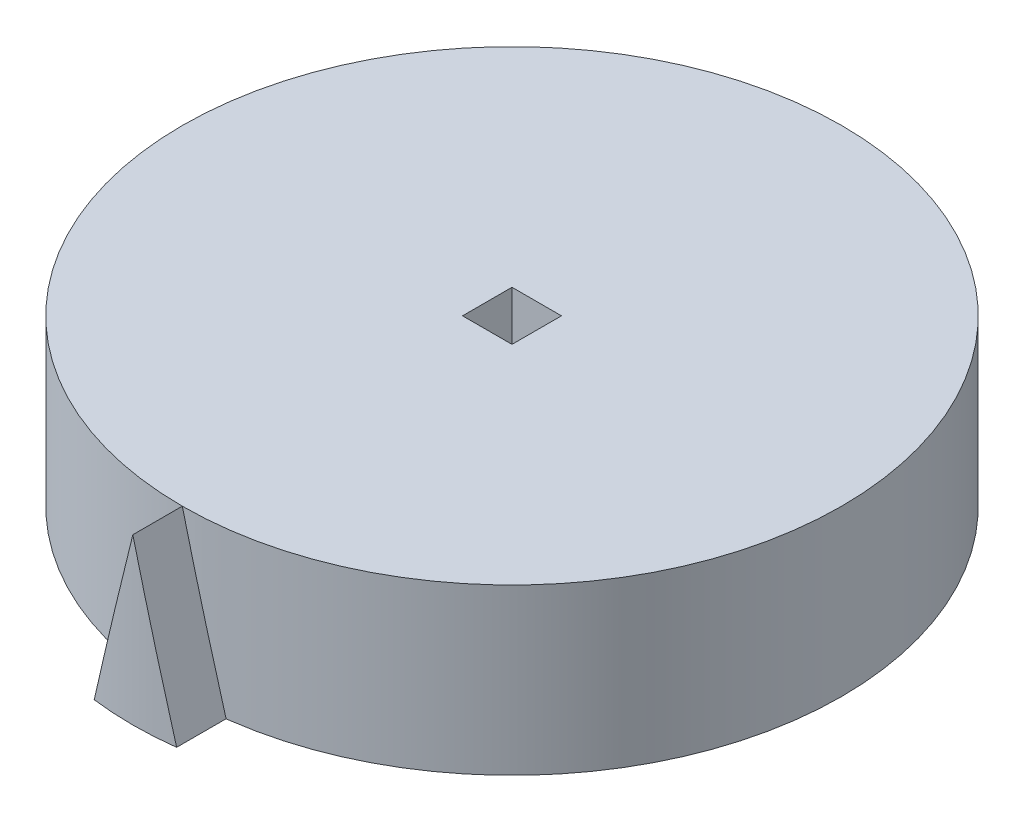
ISO-10303-21;
HEADER;
FILE_DESCRIPTION(('STEP AP214'),'2;1');
FILE_NAME('part.step','',(''),(''),'','','');
FILE_SCHEMA(('AUTOMOTIVE_DESIGN { 1 0 10303 214 1 1 1 1 }'));
ENDSEC;
DATA;
#1=APPLICATION_CONTEXT('core data for automotive mechanical design processes');
#2=APPLICATION_PROTOCOL_DEFINITION('international standard','automotive_design',2000,#1);
#3=PRODUCT_CONTEXT('',#1,'mechanical');
#4=PRODUCT('Part','Part','',(#3));
#5=PRODUCT_RELATED_PRODUCT_CATEGORY('part','',(#4));
#6=PRODUCT_DEFINITION_FORMATION('','',#4);
#7=PRODUCT_DEFINITION_CONTEXT('part definition',#1,'design');
#8=PRODUCT_DEFINITION('design','',#6,#7);
#9=PRODUCT_DEFINITION_SHAPE('','',#8);
#10=(LENGTH_UNIT() NAMED_UNIT(*) SI_UNIT(.MILLI.,.METRE.));
#11=(NAMED_UNIT(*) PLANE_ANGLE_UNIT() SI_UNIT($,.RADIAN.));
#12=(NAMED_UNIT(*) SI_UNIT($,.STERADIAN.) SOLID_ANGLE_UNIT());
#13=UNCERTAINTY_MEASURE_WITH_UNIT(LENGTH_MEASURE(1.E-05),#10,'distance_accuracy_value','');
#14=(GEOMETRIC_REPRESENTATION_CONTEXT(3) GLOBAL_UNCERTAINTY_ASSIGNED_CONTEXT((#13)) GLOBAL_UNIT_ASSIGNED_CONTEXT((#10,
#11,#12)) REPRESENTATION_CONTEXT('',''));
#15=CARTESIAN_POINT('',(0.,0.,0.));
#16=DIRECTION('',(0.,0.,1.));
#17=DIRECTION('',(1.,0.,0.));
#18=AXIS2_PLACEMENT_3D('',#15,#16,#17);
#19=CARTESIAN_POINT('',(0.,10.,0.));
#20=DIRECTION('',(0.,1.,0.));
#21=DIRECTION('',(0.,0.,1.));
#22=AXIS2_PLACEMENT_3D('',#19,#20,#21);
#23=PLANE('',#22);
#24=CARTESIAN_POINT('',(0.,10.,0.));
#25=DIRECTION('',(0.,1.,0.));
#26=DIRECTION('',(0.,0.,1.));
#27=AXIS2_PLACEMENT_3D('',#24,#25,#26);
#28=CIRCLE('',#27,20.);
#29=CARTESIAN_POINT('',(2.50842797400203E-08,10.,20.));
#30=VERTEX_POINT('',#29);
#31=EDGE_CURVE('E11',#30,#30,#28,.T.);
#32=ORIENTED_EDGE('',*,*,#31,.T.);
#33=EDGE_LOOP('',(#32));
#34=FACE_BOUND('',#33,.T.);
#35=DIRECTION('',(1.,0.,0.));
#36=VECTOR('',#35,1.);
#37=CARTESIAN_POINT('',(-1.5,10.,1.5));
#38=LINE('',#37,#36);
#39=CARTESIAN_POINT('',(-1.5,10.,1.5));
#40=VERTEX_POINT('',#39);
#41=CARTESIAN_POINT('',(1.5,10.,1.5));
#42=VERTEX_POINT('',#41);
#43=EDGE_CURVE('E132',#40,#42,#38,.T.);
#44=ORIENTED_EDGE('',*,*,#43,.F.);
#45=DIRECTION('',(0.,0.,1.));
#46=VECTOR('',#45,1.);
#47=CARTESIAN_POINT('',(-1.5,10.,-1.5));
#48=LINE('',#47,#46);
#49=CARTESIAN_POINT('',(-1.5,10.,-1.5));
#50=VERTEX_POINT('',#49);
#51=EDGE_CURVE('E134',#50,#40,#48,.T.);
#52=ORIENTED_EDGE('',*,*,#51,.F.);
#53=DIRECTION('',(-1.,0.,0.));
#54=VECTOR('',#53,1.);
#55=CARTESIAN_POINT('',(-1.5,10.,-1.5));
#56=LINE('',#55,#54);
#57=CARTESIAN_POINT('',(1.5,10.,-1.5));
#58=VERTEX_POINT('',#57);
#59=EDGE_CURVE('E140',#58,#50,#56,.T.);
#60=ORIENTED_EDGE('',*,*,#59,.F.);
#61=DIRECTION('',(0.,0.,-1.));
#62=VECTOR('',#61,1.);
#63=CARTESIAN_POINT('',(1.5,10.,-1.5));
#64=LINE('',#63,#62);
#65=EDGE_CURVE('E135',#42,#58,#64,.T.);
#66=ORIENTED_EDGE('',*,*,#65,.F.);
#67=EDGE_LOOP('',(#44,#52,#60,#66));
#68=FACE_BOUND('',#67,.T.);
#69=ADVANCED_FACE('F33',(#34,#68),#23,.T.);
#70=CARTESIAN_POINT('',(0.,0.,0.));
#71=DIRECTION('',(0.,1.,0.));
#72=DIRECTION('',(0.,0.,1.));
#73=AXIS2_PLACEMENT_3D('',#70,#71,#72);
#74=PLANE('',#73);
#75=CARTESIAN_POINT('',(0.,0.,0.));
#76=DIRECTION('',(0.,1.,0.));
#77=DIRECTION('',(0.,0.,1.));
#78=AXIS2_PLACEMENT_3D('',#75,#76,#77);
#79=CIRCLE('',#78,20.);
#80=CARTESIAN_POINT('',(0.,0.,20.));
#81=VERTEX_POINT('',#80);
#82=EDGE_CURVE('E44',#81,#81,#79,.T.);
#83=ORIENTED_EDGE('',*,*,#82,.F.);
#84=EDGE_LOOP('',(#83));
#85=FACE_BOUND('',#84,.T.);
#86=DIRECTION('',(0.,0.,1.));
#87=VECTOR('',#86,1.);
#88=CARTESIAN_POINT('',(-1.5,0.,-1.5));
#89=LINE('',#88,#87);
#90=CARTESIAN_POINT('',(-1.5,0.,-1.5));
#91=VERTEX_POINT('',#90);
#92=CARTESIAN_POINT('',(-1.5,0.,1.5));
#93=VERTEX_POINT('',#92);
#94=EDGE_CURVE('E118',#91,#93,#89,.T.);
#95=ORIENTED_EDGE('',*,*,#94,.T.);
#96=DIRECTION('',(1.,0.,0.));
#97=VECTOR('',#96,1.);
#98=CARTESIAN_POINT('',(-1.5,0.,1.5));
#99=LINE('',#98,#97);
#100=CARTESIAN_POINT('',(1.5,0.,1.5));
#101=VERTEX_POINT('',#100);
#102=EDGE_CURVE('E150',#93,#101,#99,.T.);
#103=ORIENTED_EDGE('',*,*,#102,.T.);
#104=DIRECTION('',(0.,0.,-1.));
#105=VECTOR('',#104,1.);
#106=CARTESIAN_POINT('',(1.5,0.,-1.5));
#107=LINE('',#106,#105);
#108=CARTESIAN_POINT('',(1.5,0.,-1.5));
#109=VERTEX_POINT('',#108);
#110=EDGE_CURVE('E153',#101,#109,#107,.T.);
#111=ORIENTED_EDGE('',*,*,#110,.T.);
#112=DIRECTION('',(-1.,0.,0.));
#113=VECTOR('',#112,1.);
#114=CARTESIAN_POINT('',(-1.5,0.,-1.5));
#115=LINE('',#114,#113);
#116=EDGE_CURVE('E142',#109,#91,#115,.T.);
#117=ORIENTED_EDGE('',*,*,#116,.T.);
#118=EDGE_LOOP('',(#95,#103,#111,#117));
#119=FACE_BOUND('',#118,.T.);
#120=ADVANCED_FACE('F127',(#85,#119),#74,.F.);
#121=CARTESIAN_POINT('',(0.,10.,0.));
#122=DIRECTION('',(0.,-1.,0.));
#123=DIRECTION('',(0.,0.,-1.));
#124=AXIS2_PLACEMENT_3D('',#121,#122,#123);
#125=CYLINDRICAL_SURFACE('',#124,20.);
#126=CARTESIAN_POINT('',(2.5,0.00176765201369278,19.8431348329844));
#127=CARTESIAN_POINT('',(1.25492133612456,4.98120196119248,20.));
#128=CARTESIAN_POINT('',(0.,10.,20.));
#129=B_SPLINE_CURVE_WITH_KNOTS('',2,(#126,#127,#128),.UNSPECIFIED.,.F.,.F.,(3,3),(0.,1.),.UNSPECIFIED.);
#130=CARTESIAN_POINT('',(2.5,0.00176765201369278,19.8431348329844));
#131=VERTEX_POINT('',#130);
#132=EDGE_CURVE('E111',#131,#30,#129,.T.);
#133=ORIENTED_EDGE('',*,*,#132,.F.);
#134=CARTESIAN_POINT('',(0.,0.00176765201370145,0.));
#135=DIRECTION('',(0.,1.,0.));
#136=DIRECTION('',(-1.,0.,0.));
#137=AXIS2_PLACEMENT_3D('',#134,#135,#136);
#138=CIRCLE('',#137,20.);
#139=CARTESIAN_POINT('',(-2.5,0.00176765201370926,19.8431348329844));
#140=VERTEX_POINT('',#139);
#141=EDGE_CURVE('E52',#140,#131,#138,.T.);
#142=ORIENTED_EDGE('',*,*,#141,.F.);
#143=CARTESIAN_POINT('',(0.,10.,20.));
#144=CARTESIAN_POINT('',(-1.25492133612456,4.98120196119251,20.));
#145=CARTESIAN_POINT('',(-2.5,0.00176765201371186,19.8431348329844));
#146=B_SPLINE_CURVE_WITH_KNOTS('',2,(#143,#144,#145),.UNSPECIFIED.,.F.,.F.,(3,3),(0.,1.),.UNSPECIFIED.);
#147=EDGE_CURVE('E103',#30,#140,#146,.T.);
#148=ORIENTED_EDGE('',*,*,#147,.F.);
#149=ORIENTED_EDGE('',*,*,#31,.F.);
#150=EDGE_LOOP('',(#133,#142,#148,#149));
#151=FACE_BOUND('',#150,.T.);
#152=ORIENTED_EDGE('',*,*,#82,.T.);
#153=EDGE_LOOP('',(#152));
#154=FACE_BOUND('',#153,.T.);
#155=ADVANCED_FACE('F35',(#151,#154),#125,.T.);
#156=CARTESIAN_POINT('',(-1.5,10.,-1.5));
#157=DIRECTION('',(1.,0.,0.));
#158=DIRECTION('',(0.,0.,-1.));
#159=AXIS2_PLACEMENT_3D('',#156,#157,#158);
#160=PLANE('',#159);
#161=ORIENTED_EDGE('',*,*,#94,.F.);
#162=DIRECTION('',(0.,-1.,0.));
#163=VECTOR('',#162,1.);
#164=CARTESIAN_POINT('',(-1.5,10.,-1.5));
#165=LINE('',#164,#163);
#166=EDGE_CURVE('E147',#50,#91,#165,.T.);
#167=ORIENTED_EDGE('',*,*,#166,.F.);
#168=ORIENTED_EDGE('',*,*,#51,.T.);
#169=DIRECTION('',(0.,-1.,0.));
#170=VECTOR('',#169,1.);
#171=CARTESIAN_POINT('',(-1.5,10.,1.5));
#172=LINE('',#171,#170);
#173=EDGE_CURVE('E163',#40,#93,#172,.T.);
#174=ORIENTED_EDGE('',*,*,#173,.T.);
#175=EDGE_LOOP('',(#161,#167,#168,#174));
#176=FACE_BOUND('',#175,.T.);
#177=ADVANCED_FACE('F182',(#176),#160,.T.);
#178=CARTESIAN_POINT('',(-1.5,10.,1.5));
#179=DIRECTION('',(0.,0.,-1.));
#180=DIRECTION('',(-1.,0.,0.));
#181=AXIS2_PLACEMENT_3D('',#178,#179,#180);
#182=PLANE('',#181);
#183=ORIENTED_EDGE('',*,*,#102,.F.);
#184=ORIENTED_EDGE('',*,*,#173,.F.);
#185=ORIENTED_EDGE('',*,*,#43,.T.);
#186=DIRECTION('',(0.,-1.,0.));
#187=VECTOR('',#186,1.);
#188=CARTESIAN_POINT('',(1.5,10.,1.5));
#189=LINE('',#188,#187);
#190=EDGE_CURVE('E161',#42,#101,#189,.T.);
#191=ORIENTED_EDGE('',*,*,#190,.T.);
#192=EDGE_LOOP('',(#183,#184,#185,#191));
#193=FACE_BOUND('',#192,.T.);
#194=ADVANCED_FACE('F187',(#193),#182,.T.);
#195=CARTESIAN_POINT('',(1.5,10.,-1.5));
#196=DIRECTION('',(-1.,0.,0.));
#197=DIRECTION('',(0.,0.,1.));
#198=AXIS2_PLACEMENT_3D('',#195,#196,#197);
#199=PLANE('',#198);
#200=ORIENTED_EDGE('',*,*,#110,.F.);
#201=ORIENTED_EDGE('',*,*,#190,.F.);
#202=ORIENTED_EDGE('',*,*,#65,.T.);
#203=DIRECTION('',(0.,-1.,0.));
#204=VECTOR('',#203,1.);
#205=CARTESIAN_POINT('',(1.5,10.,-1.5));
#206=LINE('',#205,#204);
#207=EDGE_CURVE('E60',#58,#109,#206,.T.);
#208=ORIENTED_EDGE('',*,*,#207,.T.);
#209=EDGE_LOOP('',(#200,#201,#202,#208));
#210=FACE_BOUND('',#209,.T.);
#211=ADVANCED_FACE('F186',(#210),#199,.T.);
#212=CARTESIAN_POINT('',(-1.5,10.,-1.5));
#213=DIRECTION('',(0.,0.,1.));
#214=DIRECTION('',(1.,0.,0.));
#215=AXIS2_PLACEMENT_3D('',#212,#213,#214);
#216=PLANE('',#215);
#217=ORIENTED_EDGE('',*,*,#116,.F.);
#218=ORIENTED_EDGE('',*,*,#207,.F.);
#219=ORIENTED_EDGE('',*,*,#59,.T.);
#220=ORIENTED_EDGE('',*,*,#166,.T.);
#221=EDGE_LOOP('',(#217,#218,#219,#220));
#222=FACE_BOUND('',#221,.T.);
#223=ADVANCED_FACE('F183',(#222),#216,.T.);
#224=CARTESIAN_POINT('',(0.,10.,3.));
#225=DIRECTION('',(0.,-1.,0.));
#226=DIRECTION('',(0.,0.,-1.));
#227=AXIS2_PLACEMENT_3D('',#224,#225,#226);
#228=CYLINDRICAL_SURFACE('',#227,20.);
#229=CARTESIAN_POINT('',(0.,0.00176765201370145,3.));
#230=DIRECTION('',(0.,1.,0.));
#231=DIRECTION('',(-1.,0.,0.));
#232=AXIS2_PLACEMENT_3D('',#229,#230,#231);
#233=CIRCLE('',#232,20.);
#234=CARTESIAN_POINT('',(-2.5,0.00176765201370926,22.8431348329844));
#235=VERTEX_POINT('',#234);
#236=CARTESIAN_POINT('',(2.5,0.00176765201369711,22.8431348329844));
#237=VERTEX_POINT('',#236);
#238=EDGE_CURVE('E225',#235,#237,#233,.T.);
#239=ORIENTED_EDGE('',*,*,#238,.T.);
#240=CARTESIAN_POINT('',(2.5,0.00176765201369278,22.8431348329844));
#241=CARTESIAN_POINT('',(2.45002307996604,0.201640294537291,22.8494313199102));
#242=CARTESIAN_POINT('',(2.40004483964416,0.401518642311657,22.8555361941008));
#243=CARTESIAN_POINT('',(2.29881308308869,0.806375446422704,22.8675142410236));
#244=CARTESIAN_POINT('',(2.24755949754091,1.01135417711984,22.8733775562176));
#245=CARTESIAN_POINT('',(2.14377678771398,1.42641174099608,22.8848438233557));
#246=CARTESIAN_POINT('',(2.09124759109164,1.63649083454131,22.8904366955915));
#247=CARTESIAN_POINT('',(1.9849138119992,2.06174913812264,22.9013326776456));
#248=CARTESIAN_POINT('',(1.93110916445667,2.27692859600325,22.9066254838643));
#249=CARTESIAN_POINT('',(1.82788225131706,2.68976356354443,22.9163578665359));
#250=CARTESIAN_POINT('',(1.77846013035831,2.88741829983014,22.9208318252337));
#251=CARTESIAN_POINT('',(1.67785049382055,3.28978773986016,22.9295624011944));
#252=CARTESIAN_POINT('',(1.62666290611263,3.49450271760146,22.9338055681755));
#253=CARTESIAN_POINT('',(1.52252205178851,3.91099264901114,22.9420347017224));
#254=CARTESIAN_POINT('',(1.46956870824217,4.1227678579979,22.9460067715736));
#255=CARTESIAN_POINT('',(1.36189648682858,4.55337825706589,22.9536524747613));
#256=CARTESIAN_POINT('',(1.30717754203584,4.77221368537031,22.9573117636765));
#257=CARTESIAN_POINT('',(1.20466198871899,5.18220416422238,22.963744212852));
#258=CARTESIAN_POINT('',(1.15686546229757,5.37335839772177,22.9665709107767));
#259=CARTESIAN_POINT('',(1.05835502067488,5.76733378392283,22.972042068891));
#260=CARTESIAN_POINT('',(1.0076410247157,5.97015521747406,22.9746648891753));
#261=CARTESIAN_POINT('',(0.903295257712679,6.38746503915662,22.9796631748865));
#262=CARTESIAN_POINT('',(0.849663392954075,6.60195367799746,22.9820157447294));
#263=CARTESIAN_POINT('',(0.739481678201726,7.04259781414264,22.9864046200188));
#264=CARTESIAN_POINT('',(0.682931733352447,7.26875352928665,22.9884167727985));
#265=CARTESIAN_POINT('',(0.587243280492364,7.65144376387275,22.9914151273792));
#266=CARTESIAN_POINT('',(0.54810420424769,7.8079771740965,22.9925264706048));
#267=CARTESIAN_POINT('',(0.46112054259165,8.15585976478901,22.9947407682189));
#268=CARTESIAN_POINT('',(0.413275809807657,8.34720927354257,22.9957868838793));
#269=CARTESIAN_POINT('',(0.30887909445184,8.76472406048805,22.9976946861589));
#270=CARTESIAN_POINT('',(0.2523267010636,8.99088954886977,22.9984881876357));
#271=CARTESIAN_POINT('',(0.130515836724114,9.47803645409856,22.9996806125868));
#272=CARTESIAN_POINT('',(0.0652572616674407,9.73901804175931,22.9999999938008));
#273=CARTESIAN_POINT('',(7.38017891924464E-09,9.99999997048448,23.));
#274=B_SPLINE_CURVE_WITH_KNOTS('',3,(#240,#241,#242,#243,#244,#245,#246,#247,#248,#249,#250,
#251,#252,#253,#254,#255,#256,#257,#258,#259,#260,#261,#262,#263,#264,#265,#266,#267,#268,#269,
#270,#271,#272,#273),.UNSPECIFIED.,.F.,.F.,(4,2,2,2,2,2,2,2,2,2,2,2,2,2,2,2,4),(0.,
0.618366876088146,1.25247870500333,1.90233551404414,2.56793733449203,3.1793040093102,
3.81248414545963,4.46747775117398,5.14428485075301,5.73546300491965,6.36270892614416,
7.02602260773432,7.72540407124014,8.20947241050989,8.80120145653298,9.50059118364829,
10.3076415746745),.UNSPECIFIED.);
#275=CARTESIAN_POINT('',(2.50842797400203E-08,10.,23.));
#276=VERTEX_POINT('',#275);
#277=EDGE_CURVE('E119',#237,#276,#274,.T.);
#278=ORIENTED_EDGE('',*,*,#277,.T.);
#279=CARTESIAN_POINT('',(0.,10.,23.));
#280=CARTESIAN_POINT('',(-0.0652552503963311,9.73902608554636,22.9999999938241));
#281=CARTESIAN_POINT('',(-0.130511821571754,9.47805251215695,22.9996806322492));
#282=CARTESIAN_POINT('',(-0.25232001470443,8.99091629157035,22.9984882701106));
#283=CARTESIAN_POINT('',(-0.308871740709871,8.76475347358598,22.997694797854));
#284=CARTESIAN_POINT('',(-0.41326845775376,8.34723868360359,22.9957870374306));
#285=CARTESIAN_POINT('',(-0.461113859506077,8.15588650144516,22.9947409239418));
#286=CARTESIAN_POINT('',(-0.548100194675059,7.80799321615897,22.9925265844573));
#287=CARTESIAN_POINT('',(-0.587241275695998,7.65145178485421,22.9914151901984));
#288=CARTESIAN_POINT('',(-0.682928824419291,7.26876515856765,22.9884168639489));
#289=CARTESIAN_POINT('',(-0.739475860153416,7.04262107247527,22.9864048270405));
#290=CARTESIAN_POINT('',(-0.849653698818471,6.60199243921056,22.9820161543279));
#291=CARTESIAN_POINT('',(-0.903284596400759,6.38750767431965,22.9796636542849));
#292=CARTESIAN_POINT('',(-1.00763036704221,5.97019785129263,22.9746654292743));
#293=CARTESIAN_POINT('',(-1.05834533373264,5.76737254261159,22.9720425846794));
#294=CARTESIAN_POINT('',(-1.15685965142076,5.37338165317166,22.9665712544395));
#295=CARTESIAN_POINT('',(-1.20465908333385,5.1822157917938,22.9637443951532));
#296=CARTESIAN_POINT('',(-1.30717455843171,4.77222560846818,22.9573119508863));
#297=CARTESIAN_POINT('',(-1.3618905195606,4.55340210286915,22.9536528738268));
#298=CARTESIAN_POINT('',(-1.46955876679732,4.1228075990738,22.9460075013729));
#299=CARTESIAN_POINT('',(-1.52251111959627,3.91103636289422,22.9420355337107));
#300=CARTESIAN_POINT('',(-1.62665197964858,3.49454643051084,22.9338064623749));
#301=CARTESIAN_POINT('',(-1.67784056373558,3.28982747927591,22.9295632397594));
#302=CARTESIAN_POINT('',(-1.77845417478346,2.88744214344609,22.9208323643744));
#303=CARTESIAN_POINT('',(-1.82787927397864,2.68977548520023,22.9163581472423));
#304=CARTESIAN_POINT('',(-1.93110781017728,2.27693399649264,22.9066256115492));
#305=CARTESIAN_POINT('',(-1.98491110253424,2.06175993861706,22.9013329441889));
#306=CARTESIAN_POINT('',(-2.09124307778368,1.63650883421669,22.8904371688999));
#307=CARTESIAN_POINT('',(-2.14377182556709,1.42643153999369,22.8848443571181));
#308=CARTESIAN_POINT('',(-2.24755453907473,1.01137397523561,22.8733781181667));
#309=CARTESIAN_POINT('',(-2.29880857706035,0.806393444511478,22.8675147635804));
#310=CARTESIAN_POINT('',(-2.4000421377044,0.401529440891488,22.8555365241478));
#311=CARTESIAN_POINT('',(-2.45002172964655,0.201645693829263,22.8494314900413));
#312=CARTESIAN_POINT('',(-2.49999999999999,0.00176765201371186,22.8431348329844));
#313=B_SPLINE_CURVE_WITH_KNOTS('',3,(#279,#280,#281,#282,#283,#284,#285,#286,#287,#288,#289,
#290,#291,#292,#293,#294,#295,#296,#297,#298,#299,#300,#301,#302,#303,#304,#305,#306,#307,#308,
#309,#310,#311,#312),.UNSPECIFIED.,.F.,.F.,(4,2,2,2,2,2,2,2,2,2,2,2,2,2,2,2,4),(0.,
0.807025608049374,1.50640707734105,2.09814439069925,2.58223753387087,3.28158303360287,
3.94488473508756,4.57214264086204,5.16335675436368,5.84012697746741,6.49510829621463,
7.12830072275501,7.73970427062782,8.40528938356624,9.05514062641156,9.68925802449797,
10.3076416051258),.UNSPECIFIED.);
#314=EDGE_CURVE('E105',#276,#235,#313,.T.);
#315=ORIENTED_EDGE('',*,*,#314,.T.);
#316=EDGE_LOOP('',(#239,#278,#315));
#317=FACE_BOUND('',#316,.T.);
#318=ADVANCED_FACE('F199',(#317),#228,.T.);
#319=CARTESIAN_POINT('',(2.5,0.00176765201369278,19.8431348329844));
#320=DIRECTION('',(0.,-1.,0.));
#321=DIRECTION('',(1.,0.,0.));
#322=AXIS2_PLACEMENT_3D('',#319,#320,#321);
#323=PLANE('',#322);
#324=ORIENTED_EDGE('',*,*,#238,.F.);
#325=DIRECTION('',(0.,0.,1.));
#326=VECTOR('',#325,1.);
#327=CARTESIAN_POINT('',(-2.5,0.00176765201371186,19.8431348329844));
#328=LINE('',#327,#326);
#329=EDGE_CURVE('E233',#140,#235,#328,.T.);
#330=ORIENTED_EDGE('',*,*,#329,.F.);
#331=ORIENTED_EDGE('',*,*,#141,.T.);
#332=DIRECTION('',(0.,0.,1.));
#333=VECTOR('',#332,1.);
#334=CARTESIAN_POINT('',(2.5,0.00176765201369278,19.8431348329844));
#335=LINE('',#334,#333);
#336=EDGE_CURVE('E114',#131,#237,#335,.T.);
#337=ORIENTED_EDGE('',*,*,#336,.T.);
#338=EDGE_LOOP('',(#324,#330,#331,#337));
#339=FACE_BOUND('',#338,.T.);
#340=ADVANCED_FACE('F203',(#339),#323,.T.);
#341=CARTESIAN_POINT('',(-2.5,0.00176765201371186,19.8431348329844));
#342=DIRECTION('',(-0.970132410131298,0.242575981525047,0.));
#343=DIRECTION('',(-0.242575981525047,-0.970132410131298,0.));
#344=AXIS2_PLACEMENT_3D('',#341,#342,#343);
#345=PLANE('',#344);
#346=ORIENTED_EDGE('',*,*,#314,.F.);
#347=DIRECTION('',(0.,0.,1.));
#348=VECTOR('',#347,1.);
#349=CARTESIAN_POINT('',(0.,10.,20.));
#350=LINE('',#349,#348);
#351=EDGE_CURVE('E98',#30,#276,#350,.T.);
#352=ORIENTED_EDGE('',*,*,#351,.F.);
#353=ORIENTED_EDGE('',*,*,#147,.T.);
#354=ORIENTED_EDGE('',*,*,#329,.T.);
#355=EDGE_LOOP('',(#346,#352,#353,#354));
#356=FACE_BOUND('',#355,.T.);
#357=ADVANCED_FACE('F100',(#356),#345,.T.);
#358=CARTESIAN_POINT('',(0.,10.,20.));
#359=DIRECTION('',(0.970132410131298,0.242575981525046,0.));
#360=DIRECTION('',(-0.242575981525046,0.970132410131298,0.));
#361=AXIS2_PLACEMENT_3D('',#358,#359,#360);
#362=PLANE('',#361);
#363=ORIENTED_EDGE('',*,*,#277,.F.);
#364=ORIENTED_EDGE('',*,*,#336,.F.);
#365=ORIENTED_EDGE('',*,*,#132,.T.);
#366=ORIENTED_EDGE('',*,*,#351,.T.);
#367=EDGE_LOOP('',(#363,#364,#365,#366));
#368=FACE_BOUND('',#367,.T.);
#369=ADVANCED_FACE('F113',(#368),#362,.T.);
#370=CLOSED_SHELL('',(#69,#120,#155,#177,#194,#211,#223,#318,#340,#357,#369));
#371=MANIFOLD_SOLID_BREP('B2',#370);
#372=ADVANCED_BREP_SHAPE_REPRESENTATION('',(#18,#371),#14);
#373=SHAPE_DEFINITION_REPRESENTATION(#9,#372);
ENDSEC;
END-ISO-10303-21;
